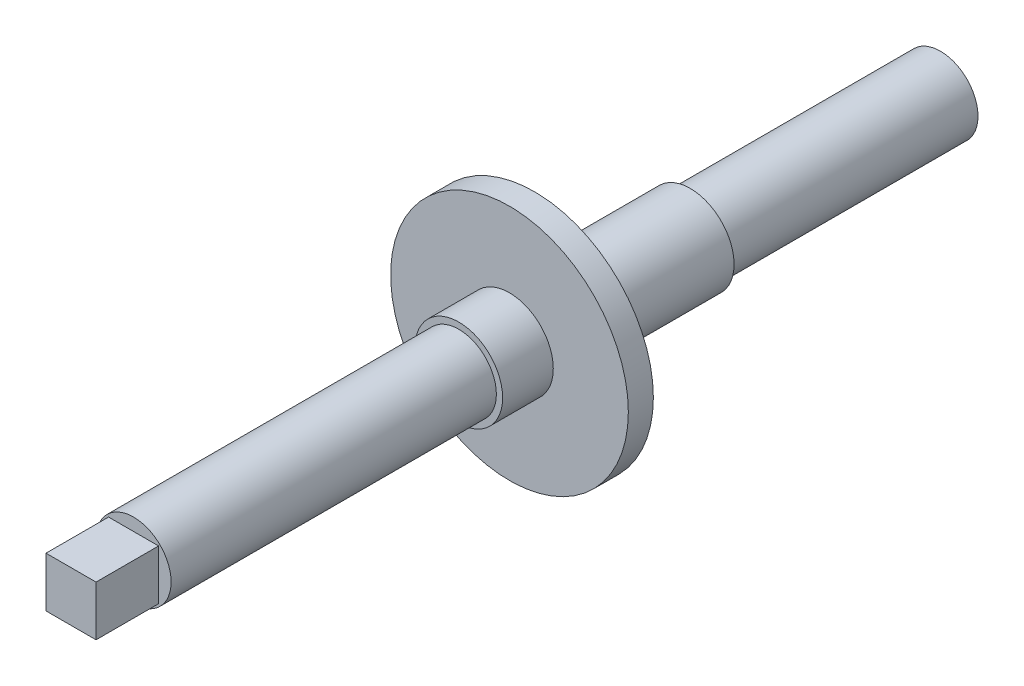
ISO-10303-21;
HEADER;
FILE_DESCRIPTION(('STEP AP214'),'2;1');
FILE_NAME('part.step','',(''),(''),'','','');
FILE_SCHEMA(('AUTOMOTIVE_DESIGN { 1 0 10303 214 1 1 1 1 }'));
ENDSEC;
DATA;
#1=APPLICATION_CONTEXT('core data for automotive mechanical design processes');
#2=APPLICATION_PROTOCOL_DEFINITION('international standard','automotive_design',2000,#1);
#3=PRODUCT_CONTEXT('',#1,'mechanical');
#4=PRODUCT('Part','Part','',(#3));
#5=PRODUCT_RELATED_PRODUCT_CATEGORY('part','',(#4));
#6=PRODUCT_DEFINITION_FORMATION('','',#4);
#7=PRODUCT_DEFINITION_CONTEXT('part definition',#1,'design');
#8=PRODUCT_DEFINITION('design','',#6,#7);
#9=PRODUCT_DEFINITION_SHAPE('','',#8);
#10=(LENGTH_UNIT() NAMED_UNIT(*) SI_UNIT(.MILLI.,.METRE.));
#11=(NAMED_UNIT(*) PLANE_ANGLE_UNIT() SI_UNIT($,.RADIAN.));
#12=(NAMED_UNIT(*) SI_UNIT($,.STERADIAN.) SOLID_ANGLE_UNIT());
#13=UNCERTAINTY_MEASURE_WITH_UNIT(LENGTH_MEASURE(1.E-05),#10,'distance_accuracy_value','');
#14=(GEOMETRIC_REPRESENTATION_CONTEXT(3) GLOBAL_UNCERTAINTY_ASSIGNED_CONTEXT((#13)) GLOBAL_UNIT_ASSIGNED_CONTEXT((#10,
#11,#12)) REPRESENTATION_CONTEXT('',''));
#15=CARTESIAN_POINT('',(0.,0.,0.));
#16=DIRECTION('',(0.,0.,1.));
#17=DIRECTION('',(1.,0.,0.));
#18=AXIS2_PLACEMENT_3D('',#15,#16,#17);
#19=CARTESIAN_POINT('',(0.,0.,64.5));
#20=DIRECTION('',(0.,0.,1.));
#21=DIRECTION('',(1.,0.,0.));
#22=AXIS2_PLACEMENT_3D('',#19,#20,#21);
#23=PLANE('',#22);
#24=CARTESIAN_POINT('',(0.,0.,64.5));
#25=DIRECTION('',(0.,0.,1.));
#26=DIRECTION('',(1.,0.,0.));
#27=AXIS2_PLACEMENT_3D('',#24,#25,#26);
#28=CIRCLE('',#27,3.);
#29=CARTESIAN_POINT('',(3.,0.,64.5));
#30=VERTEX_POINT('',#29);
#31=EDGE_CURVE('E113',#30,#30,#28,.T.);
#32=ORIENTED_EDGE('',*,*,#31,.T.);
#33=EDGE_LOOP('',(#32));
#34=FACE_BOUND('',#33,.T.);
#35=DIRECTION('',(-1.,0.,0.));
#36=VECTOR('',#35,1.);
#37=CARTESIAN_POINT('',(-2.,2.,64.5));
#38=LINE('',#37,#36);
#39=CARTESIAN_POINT('',(2.,2.,64.5));
#40=VERTEX_POINT('',#39);
#41=CARTESIAN_POINT('',(-2.,2.,64.5));
#42=VERTEX_POINT('',#41);
#43=EDGE_CURVE('E91',#40,#42,#38,.T.);
#44=ORIENTED_EDGE('',*,*,#43,.F.);
#45=DIRECTION('',(0.,1.,0.));
#46=VECTOR('',#45,1.);
#47=CARTESIAN_POINT('',(2.,-2.,64.5));
#48=LINE('',#47,#46);
#49=CARTESIAN_POINT('',(2.,-2.,64.5));
#50=VERTEX_POINT('',#49);
#51=EDGE_CURVE('E102',#50,#40,#48,.T.);
#52=ORIENTED_EDGE('',*,*,#51,.F.);
#53=DIRECTION('',(1.,0.,0.));
#54=VECTOR('',#53,1.);
#55=CARTESIAN_POINT('',(-2.,-2.,64.5));
#56=LINE('',#55,#54);
#57=CARTESIAN_POINT('',(-2.,-2.,64.5));
#58=VERTEX_POINT('',#57);
#59=EDGE_CURVE('E72',#58,#50,#56,.T.);
#60=ORIENTED_EDGE('',*,*,#59,.F.);
#61=DIRECTION('',(0.,-1.,0.));
#62=VECTOR('',#61,1.);
#63=CARTESIAN_POINT('',(-2.,-2.,64.5));
#64=LINE('',#63,#62);
#65=EDGE_CURVE('E106',#42,#58,#64,.T.);
#66=ORIENTED_EDGE('',*,*,#65,.F.);
#67=EDGE_LOOP('',(#44,#52,#60,#66));
#68=FACE_BOUND('',#67,.T.);
#69=ADVANCED_FACE('F35',(#34,#68),#23,.T.);
#70=CARTESIAN_POINT('',(0.,0.,20.));
#71=DIRECTION('',(0.,0.,-1.));
#72=DIRECTION('',(-1.,0.,0.));
#73=AXIS2_PLACEMENT_3D('',#70,#71,#72);
#74=CYLINDRICAL_SURFACE('',#73,3.);
#75=CARTESIAN_POINT('',(0.,0.,20.));
#76=DIRECTION('',(0.,0.,1.));
#77=DIRECTION('',(1.,0.,0.));
#78=AXIS2_PLACEMENT_3D('',#75,#76,#77);
#79=CIRCLE('',#78,3.);
#80=CARTESIAN_POINT('',(3.,0.,20.));
#81=VERTEX_POINT('',#80);
#82=EDGE_CURVE('E11',#81,#81,#79,.T.);
#83=ORIENTED_EDGE('',*,*,#82,.F.);
#84=EDGE_LOOP('',(#83));
#85=FACE_BOUND('',#84,.T.);
#86=CARTESIAN_POINT('',(0.,0.,0.));
#87=DIRECTION('',(0.,0.,1.));
#88=DIRECTION('',(1.,0.,0.));
#89=AXIS2_PLACEMENT_3D('',#86,#87,#88);
#90=CIRCLE('',#89,3.);
#91=CARTESIAN_POINT('',(3.,0.,0.));
#92=VERTEX_POINT('',#91);
#93=EDGE_CURVE('E39',#92,#92,#90,.T.);
#94=ORIENTED_EDGE('',*,*,#93,.T.);
#95=EDGE_LOOP('',(#94));
#96=FACE_BOUND('',#95,.T.);
#97=ADVANCED_FACE('F37',(#85,#96),#74,.T.);
#98=CARTESIAN_POINT('',(0.,0.,0.));
#99=DIRECTION('',(0.,0.,1.));
#100=DIRECTION('',(1.,0.,0.));
#101=AXIS2_PLACEMENT_3D('',#98,#99,#100);
#102=PLANE('',#101);
#103=ORIENTED_EDGE('',*,*,#93,.F.);
#104=EDGE_LOOP('',(#103));
#105=FACE_BOUND('',#104,.T.);
#106=ADVANCED_FACE('F151',(#105),#102,.F.);
#107=CARTESIAN_POINT('',(0.,0.,32.45));
#108=DIRECTION('',(0.,0.,-1.));
#109=DIRECTION('',(-1.,0.,0.));
#110=AXIS2_PLACEMENT_3D('',#107,#108,#109);
#111=CYLINDRICAL_SURFACE('',#110,3.5);
#112=CARTESIAN_POINT('',(0.,0.,32.45));
#113=DIRECTION('',(0.,0.,1.));
#114=DIRECTION('',(1.,0.,0.));
#115=AXIS2_PLACEMENT_3D('',#112,#113,#114);
#116=CIRCLE('',#115,3.5);
#117=CARTESIAN_POINT('',(3.5,0.,32.45));
#118=VERTEX_POINT('',#117);
#119=EDGE_CURVE('E131',#118,#118,#116,.T.);
#120=ORIENTED_EDGE('',*,*,#119,.F.);
#121=EDGE_LOOP('',(#120));
#122=FACE_BOUND('',#121,.T.);
#123=CARTESIAN_POINT('',(0.,0.,20.));
#124=DIRECTION('',(0.,0.,1.));
#125=DIRECTION('',(1.,0.,0.));
#126=AXIS2_PLACEMENT_3D('',#123,#124,#125);
#127=CIRCLE('',#126,3.5);
#128=CARTESIAN_POINT('',(3.5,0.,20.));
#129=VERTEX_POINT('',#128);
#130=EDGE_CURVE('E128',#129,#129,#127,.T.);
#131=ORIENTED_EDGE('',*,*,#130,.T.);
#132=EDGE_LOOP('',(#131));
#133=FACE_BOUND('',#132,.T.);
#134=ADVANCED_FACE('F137',(#122,#133),#111,.T.);
#135=CARTESIAN_POINT('',(0.,0.,20.));
#136=DIRECTION('',(0.,0.,1.));
#137=DIRECTION('',(1.,0.,0.));
#138=AXIS2_PLACEMENT_3D('',#135,#136,#137);
#139=PLANE('',#138);
#140=ORIENTED_EDGE('',*,*,#82,.T.);
#141=EDGE_LOOP('',(#140));
#142=FACE_BOUND('',#141,.T.);
#143=ORIENTED_EDGE('',*,*,#130,.F.);
#144=EDGE_LOOP('',(#143));
#145=FACE_BOUND('',#144,.T.);
#146=ADVANCED_FACE('F139',(#142,#145),#139,.F.);
#147=CARTESIAN_POINT('',(0.,0.,34.45));
#148=DIRECTION('',(0.,0.,-1.));
#149=DIRECTION('',(-1.,0.,0.));
#150=AXIS2_PLACEMENT_3D('',#147,#148,#149);
#151=CYLINDRICAL_SURFACE('',#150,9.5);
#152=CARTESIAN_POINT('',(0.,0.,34.45));
#153=DIRECTION('',(0.,0.,1.));
#154=DIRECTION('',(1.,0.,0.));
#155=AXIS2_PLACEMENT_3D('',#152,#153,#154);
#156=CIRCLE('',#155,9.5);
#157=CARTESIAN_POINT('',(9.5,0.,34.45));
#158=VERTEX_POINT('',#157);
#159=EDGE_CURVE('E125',#158,#158,#156,.T.);
#160=ORIENTED_EDGE('',*,*,#159,.F.);
#161=EDGE_LOOP('',(#160));
#162=FACE_BOUND('',#161,.T.);
#163=CARTESIAN_POINT('',(0.,0.,32.45));
#164=DIRECTION('',(0.,0.,1.));
#165=DIRECTION('',(1.,0.,0.));
#166=AXIS2_PLACEMENT_3D('',#163,#164,#165);
#167=CIRCLE('',#166,9.5);
#168=CARTESIAN_POINT('',(9.5,0.,32.45));
#169=VERTEX_POINT('',#168);
#170=EDGE_CURVE('E122',#169,#169,#167,.T.);
#171=ORIENTED_EDGE('',*,*,#170,.T.);
#172=EDGE_LOOP('',(#171));
#173=FACE_BOUND('',#172,.T.);
#174=ADVANCED_FACE('F141',(#162,#173),#151,.T.);
#175=CARTESIAN_POINT('',(0.,0.,34.45));
#176=DIRECTION('',(0.,0.,1.));
#177=DIRECTION('',(1.,0.,0.));
#178=AXIS2_PLACEMENT_3D('',#175,#176,#177);
#179=PLANE('',#178);
#180=CARTESIAN_POINT('',(0.,0.,34.45));
#181=DIRECTION('',(0.,0.,1.));
#182=DIRECTION('',(1.,0.,0.));
#183=AXIS2_PLACEMENT_3D('',#180,#181,#182);
#184=CIRCLE('',#183,3.5);
#185=CARTESIAN_POINT('',(3.5,0.,34.45));
#186=VERTEX_POINT('',#185);
#187=EDGE_CURVE('E116',#186,#186,#184,.T.);
#188=ORIENTED_EDGE('',*,*,#187,.F.);
#189=EDGE_LOOP('',(#188));
#190=FACE_BOUND('',#189,.T.);
#191=ORIENTED_EDGE('',*,*,#159,.T.);
#192=EDGE_LOOP('',(#191));
#193=FACE_BOUND('',#192,.T.);
#194=ADVANCED_FACE('F148',(#190,#193),#179,.T.);
#195=CARTESIAN_POINT('',(0.,0.,32.45));
#196=DIRECTION('',(0.,0.,1.));
#197=DIRECTION('',(1.,0.,0.));
#198=AXIS2_PLACEMENT_3D('',#195,#196,#197);
#199=PLANE('',#198);
#200=ORIENTED_EDGE('',*,*,#119,.T.);
#201=EDGE_LOOP('',(#200));
#202=FACE_BOUND('',#201,.T.);
#203=ORIENTED_EDGE('',*,*,#170,.F.);
#204=EDGE_LOOP('',(#203));
#205=FACE_BOUND('',#204,.T.);
#206=ADVANCED_FACE('F177',(#202,#205),#199,.F.);
#207=CARTESIAN_POINT('',(0.,0.,38.5));
#208=DIRECTION('',(0.,0.,-1.));
#209=DIRECTION('',(-1.,0.,0.));
#210=AXIS2_PLACEMENT_3D('',#207,#208,#209);
#211=CYLINDRICAL_SURFACE('',#210,3.5);
#212=CARTESIAN_POINT('',(0.,0.,38.5));
#213=DIRECTION('',(0.,0.,1.));
#214=DIRECTION('',(1.,0.,0.));
#215=AXIS2_PLACEMENT_3D('',#212,#213,#214);
#216=CIRCLE('',#215,3.5);
#217=CARTESIAN_POINT('',(3.5,0.,38.5));
#218=VERTEX_POINT('',#217);
#219=EDGE_CURVE('E119',#218,#218,#216,.T.);
#220=ORIENTED_EDGE('',*,*,#219,.F.);
#221=EDGE_LOOP('',(#220));
#222=FACE_BOUND('',#221,.T.);
#223=ORIENTED_EDGE('',*,*,#187,.T.);
#224=EDGE_LOOP('',(#223));
#225=FACE_BOUND('',#224,.T.);
#226=ADVANCED_FACE('F173',(#222,#225),#211,.T.);
#227=CARTESIAN_POINT('',(0.,0.,38.5));
#228=DIRECTION('',(0.,0.,1.));
#229=DIRECTION('',(1.,0.,0.));
#230=AXIS2_PLACEMENT_3D('',#227,#228,#229);
#231=PLANE('',#230);
#232=CARTESIAN_POINT('',(0.,0.,38.5));
#233=DIRECTION('',(0.,0.,1.));
#234=DIRECTION('',(1.,0.,0.));
#235=AXIS2_PLACEMENT_3D('',#232,#233,#234);
#236=CIRCLE('',#235,3.);
#237=CARTESIAN_POINT('',(3.,0.,38.5));
#238=VERTEX_POINT('',#237);
#239=EDGE_CURVE('E112',#238,#238,#236,.T.);
#240=ORIENTED_EDGE('',*,*,#239,.F.);
#241=EDGE_LOOP('',(#240));
#242=FACE_BOUND('',#241,.T.);
#243=ORIENTED_EDGE('',*,*,#219,.T.);
#244=EDGE_LOOP('',(#243));
#245=FACE_BOUND('',#244,.T.);
#246=ADVANCED_FACE('F169',(#242,#245),#231,.T.);
#247=CARTESIAN_POINT('',(0.,0.,64.5));
#248=DIRECTION('',(0.,0.,-1.));
#249=DIRECTION('',(-1.,0.,0.));
#250=AXIS2_PLACEMENT_3D('',#247,#248,#249);
#251=CYLINDRICAL_SURFACE('',#250,3.);
#252=ORIENTED_EDGE('',*,*,#31,.F.);
#253=EDGE_LOOP('',(#252));
#254=FACE_BOUND('',#253,.T.);
#255=ORIENTED_EDGE('',*,*,#239,.T.);
#256=EDGE_LOOP('',(#255));
#257=FACE_BOUND('',#256,.T.);
#258=ADVANCED_FACE('F166',(#254,#257),#251,.T.);
#259=CARTESIAN_POINT('',(2.,-2.,69.5));
#260=DIRECTION('',(-1.,0.,0.));
#261=DIRECTION('',(0.,0.,1.));
#262=AXIS2_PLACEMENT_3D('',#259,#260,#261);
#263=PLANE('',#262);
#264=ORIENTED_EDGE('',*,*,#51,.T.);
#265=DIRECTION('',(0.,0.,-1.));
#266=VECTOR('',#265,1.);
#267=CARTESIAN_POINT('',(2.,2.,69.5));
#268=LINE('',#267,#266);
#269=CARTESIAN_POINT('',(2.,2.,69.5));
#270=VERTEX_POINT('',#269);
#271=EDGE_CURVE('E94',#270,#40,#268,.T.);
#272=ORIENTED_EDGE('',*,*,#271,.F.);
#273=DIRECTION('',(0.,1.,0.));
#274=VECTOR('',#273,1.);
#275=CARTESIAN_POINT('',(2.,-2.,69.5));
#276=LINE('',#275,#274);
#277=CARTESIAN_POINT('',(2.,-2.,69.5));
#278=VERTEX_POINT('',#277);
#279=EDGE_CURVE('E84',#278,#270,#276,.T.);
#280=ORIENTED_EDGE('',*,*,#279,.F.);
#281=DIRECTION('',(0.,0.,-1.));
#282=VECTOR('',#281,1.);
#283=CARTESIAN_POINT('',(2.,-2.,69.5));
#284=LINE('',#283,#282);
#285=EDGE_CURVE('E98',#278,#50,#284,.T.);
#286=ORIENTED_EDGE('',*,*,#285,.T.);
#287=EDGE_LOOP('',(#264,#272,#280,#286));
#288=FACE_BOUND('',#287,.T.);
#289=ADVANCED_FACE('F164',(#288),#263,.F.);
#290=CARTESIAN_POINT('',(-2.,2.,69.5));
#291=DIRECTION('',(0.,-1.,0.));
#292=DIRECTION('',(0.,0.,-1.));
#293=AXIS2_PLACEMENT_3D('',#290,#291,#292);
#294=PLANE('',#293);
#295=ORIENTED_EDGE('',*,*,#43,.T.);
#296=DIRECTION('',(0.,0.,-1.));
#297=VECTOR('',#296,1.);
#298=CARTESIAN_POINT('',(-2.,2.,69.5));
#299=LINE('',#298,#297);
#300=CARTESIAN_POINT('',(-2.,2.,69.5));
#301=VERTEX_POINT('',#300);
#302=EDGE_CURVE('E88',#301,#42,#299,.T.);
#303=ORIENTED_EDGE('',*,*,#302,.F.);
#304=DIRECTION('',(-1.,0.,0.));
#305=VECTOR('',#304,1.);
#306=CARTESIAN_POINT('',(-2.,2.,69.5));
#307=LINE('',#306,#305);
#308=EDGE_CURVE('E79',#270,#301,#307,.T.);
#309=ORIENTED_EDGE('',*,*,#308,.F.);
#310=ORIENTED_EDGE('',*,*,#271,.T.);
#311=EDGE_LOOP('',(#295,#303,#309,#310));
#312=FACE_BOUND('',#311,.T.);
#313=ADVANCED_FACE('F89',(#312),#294,.F.);
#314=CARTESIAN_POINT('',(-2.,-2.,69.5));
#315=DIRECTION('',(1.,0.,0.));
#316=DIRECTION('',(0.,0.,-1.));
#317=AXIS2_PLACEMENT_3D('',#314,#315,#316);
#318=PLANE('',#317);
#319=ORIENTED_EDGE('',*,*,#65,.T.);
#320=DIRECTION('',(0.,0.,-1.));
#321=VECTOR('',#320,1.);
#322=CARTESIAN_POINT('',(-2.,-2.,69.5));
#323=LINE('',#322,#321);
#324=CARTESIAN_POINT('',(-2.,-2.,69.5));
#325=VERTEX_POINT('',#324);
#326=EDGE_CURVE('E50',#325,#58,#323,.T.);
#327=ORIENTED_EDGE('',*,*,#326,.F.);
#328=DIRECTION('',(0.,-1.,0.));
#329=VECTOR('',#328,1.);
#330=CARTESIAN_POINT('',(-2.,-2.,69.5));
#331=LINE('',#330,#329);
#332=EDGE_CURVE('E82',#301,#325,#331,.T.);
#333=ORIENTED_EDGE('',*,*,#332,.F.);
#334=ORIENTED_EDGE('',*,*,#302,.T.);
#335=EDGE_LOOP('',(#319,#327,#333,#334));
#336=FACE_BOUND('',#335,.T.);
#337=ADVANCED_FACE('F96',(#336),#318,.F.);
#338=CARTESIAN_POINT('',(-2.,-2.,69.5));
#339=DIRECTION('',(0.,1.,0.));
#340=DIRECTION('',(0.,0.,1.));
#341=AXIS2_PLACEMENT_3D('',#338,#339,#340);
#342=PLANE('',#341);
#343=ORIENTED_EDGE('',*,*,#59,.T.);
#344=ORIENTED_EDGE('',*,*,#285,.F.);
#345=DIRECTION('',(1.,0.,0.));
#346=VECTOR('',#345,1.);
#347=CARTESIAN_POINT('',(-2.,-2.,69.5));
#348=LINE('',#347,#346);
#349=EDGE_CURVE('E58',#325,#278,#348,.T.);
#350=ORIENTED_EDGE('',*,*,#349,.F.);
#351=ORIENTED_EDGE('',*,*,#326,.T.);
#352=EDGE_LOOP('',(#343,#344,#350,#351));
#353=FACE_BOUND('',#352,.T.);
#354=ADVANCED_FACE('F222',(#353),#342,.F.);
#355=CARTESIAN_POINT('',(0.,0.,69.5));
#356=DIRECTION('',(0.,0.,-1.));
#357=DIRECTION('',(-1.,0.,0.));
#358=AXIS2_PLACEMENT_3D('',#355,#356,#357);
#359=PLANE('',#358);
#360=ORIENTED_EDGE('',*,*,#279,.T.);
#361=ORIENTED_EDGE('',*,*,#308,.T.);
#362=ORIENTED_EDGE('',*,*,#332,.T.);
#363=ORIENTED_EDGE('',*,*,#349,.T.);
#364=EDGE_LOOP('',(#360,#361,#362,#363));
#365=FACE_BOUND('',#364,.T.);
#366=ADVANCED_FACE('F80',(#365),#359,.F.);
#367=CLOSED_SHELL('',(#69,#97,#106,#134,#146,#174,#194,#206,#226,#246,#258,#289,#313,#337,#354,#366));
#368=MANIFOLD_SOLID_BREP('B2',#367);
#369=ADVANCED_BREP_SHAPE_REPRESENTATION('',(#18,#368),#14);
#370=SHAPE_DEFINITION_REPRESENTATION(#9,#369);
ENDSEC;
END-ISO-10303-21;
